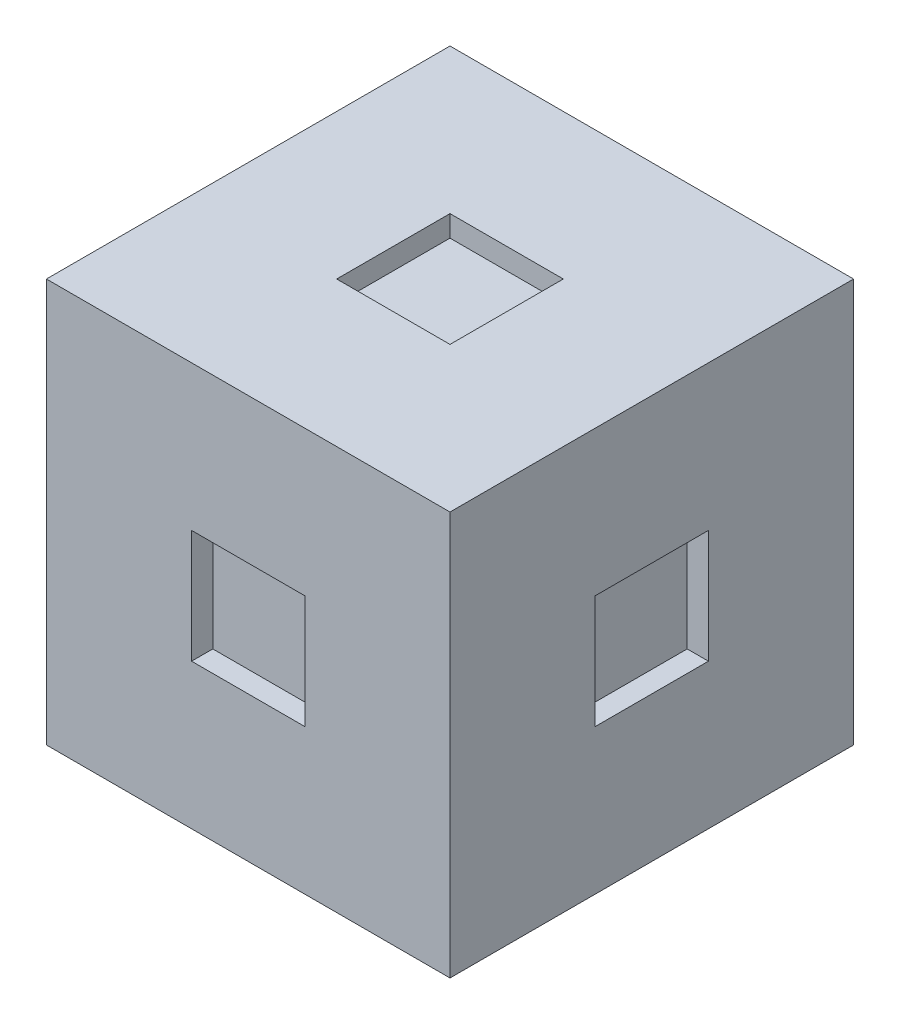
ISO-10303-21;
HEADER;
FILE_DESCRIPTION(('STEP AP214'),'2;1');
FILE_NAME('part.step','',(''),(''),'','','');
FILE_SCHEMA(('AUTOMOTIVE_DESIGN { 1 0 10303 214 1 1 1 1 }'));
ENDSEC;
DATA;
#1=APPLICATION_CONTEXT('core data for automotive mechanical design processes');
#2=APPLICATION_PROTOCOL_DEFINITION('international standard','automotive_design',2000,#1);
#3=PRODUCT_CONTEXT('',#1,'mechanical');
#4=PRODUCT('Part','Part','',(#3));
#5=PRODUCT_RELATED_PRODUCT_CATEGORY('part','',(#4));
#6=PRODUCT_DEFINITION_FORMATION('','',#4);
#7=PRODUCT_DEFINITION_CONTEXT('part definition',#1,'design');
#8=PRODUCT_DEFINITION('design','',#6,#7);
#9=PRODUCT_DEFINITION_SHAPE('','',#8);
#10=(LENGTH_UNIT() NAMED_UNIT(*) SI_UNIT(.MILLI.,.METRE.));
#11=(NAMED_UNIT(*) PLANE_ANGLE_UNIT() SI_UNIT($,.RADIAN.));
#12=(NAMED_UNIT(*) SI_UNIT($,.STERADIAN.) SOLID_ANGLE_UNIT());
#13=UNCERTAINTY_MEASURE_WITH_UNIT(LENGTH_MEASURE(1.E-05),#10,'distance_accuracy_value','');
#14=(GEOMETRIC_REPRESENTATION_CONTEXT(3) GLOBAL_UNCERTAINTY_ASSIGNED_CONTEXT((#13)) GLOBAL_UNIT_ASSIGNED_CONTEXT((#10,
#11,#12)) REPRESENTATION_CONTEXT('',''));
#15=CARTESIAN_POINT('',(0.,0.,0.));
#16=DIRECTION('',(0.,0.,1.));
#17=DIRECTION('',(1.,0.,0.));
#18=AXIS2_PLACEMENT_3D('',#15,#16,#17);
#19=CARTESIAN_POINT('',(28.5,57.,-28.5));
#20=DIRECTION('',(-1.,0.,0.));
#21=DIRECTION('',(0.,0.,1.));
#22=AXIS2_PLACEMENT_3D('',#19,#20,#21);
#23=PLANE('',#22);
#24=DIRECTION('',(0.,0.,1.));
#25=VECTOR('',#24,1.);
#26=CARTESIAN_POINT('',(28.5,36.5,8.));
#27=LINE('',#26,#25);
#28=CARTESIAN_POINT('',(28.5,36.5,-8.));
#29=VERTEX_POINT('',#28);
#30=CARTESIAN_POINT('',(28.5,36.5,8.));
#31=VERTEX_POINT('',#30);
#32=EDGE_CURVE('E426',#29,#31,#27,.T.);
#33=ORIENTED_EDGE('',*,*,#32,.F.);
#34=DIRECTION('',(0.,1.,0.));
#35=VECTOR('',#34,1.);
#36=CARTESIAN_POINT('',(28.5,36.5,-8.));
#37=LINE('',#36,#35);
#38=CARTESIAN_POINT('',(28.5,20.5,-8.));
#39=VERTEX_POINT('',#38);
#40=EDGE_CURVE('E396',#39,#29,#37,.T.);
#41=ORIENTED_EDGE('',*,*,#40,.F.);
#42=DIRECTION('',(0.,0.,-1.));
#43=VECTOR('',#42,1.);
#44=CARTESIAN_POINT('',(28.5,20.5,8.));
#45=LINE('',#44,#43);
#46=CARTESIAN_POINT('',(28.5,20.5,8.));
#47=VERTEX_POINT('',#46);
#48=EDGE_CURVE('E411',#47,#39,#45,.T.);
#49=ORIENTED_EDGE('',*,*,#48,.F.);
#50=DIRECTION('',(0.,-1.,0.));
#51=VECTOR('',#50,1.);
#52=CARTESIAN_POINT('',(28.5,36.5,8.));
#53=LINE('',#52,#51);
#54=EDGE_CURVE('E430',#31,#47,#53,.T.);
#55=ORIENTED_EDGE('',*,*,#54,.F.);
#56=EDGE_LOOP('',(#33,#41,#49,#55));
#57=FACE_BOUND('',#56,.T.);
#58=DIRECTION('',(0.,0.,-1.));
#59=VECTOR('',#58,1.);
#60=CARTESIAN_POINT('',(28.5,0.,-28.5));
#61=LINE('',#60,#59);
#62=CARTESIAN_POINT('',(28.5,0.,28.5));
#63=VERTEX_POINT('',#62);
#64=CARTESIAN_POINT('',(28.5,0.,-28.5));
#65=VERTEX_POINT('',#64);
#66=EDGE_CURVE('E484',#63,#65,#61,.T.);
#67=ORIENTED_EDGE('',*,*,#66,.T.);
#68=DIRECTION('',(0.,-1.,0.));
#69=VECTOR('',#68,1.);
#70=CARTESIAN_POINT('',(28.5,57.,-28.5));
#71=LINE('',#70,#69);
#72=CARTESIAN_POINT('',(28.5,57.,-28.5));
#73=VERTEX_POINT('',#72);
#74=EDGE_CURVE('E11',#73,#65,#71,.T.);
#75=ORIENTED_EDGE('',*,*,#74,.F.);
#76=DIRECTION('',(0.,0.,-1.));
#77=VECTOR('',#76,1.);
#78=CARTESIAN_POINT('',(28.5,57.,-28.5));
#79=LINE('',#78,#77);
#80=CARTESIAN_POINT('',(28.5,57.,28.5));
#81=VERTEX_POINT('',#80);
#82=EDGE_CURVE('E494',#81,#73,#79,.T.);
#83=ORIENTED_EDGE('',*,*,#82,.F.);
#84=DIRECTION('',(0.,-1.,0.));
#85=VECTOR('',#84,1.);
#86=CARTESIAN_POINT('',(28.5,57.,28.5));
#87=LINE('',#86,#85);
#88=EDGE_CURVE('E508',#81,#63,#87,.T.);
#89=ORIENTED_EDGE('',*,*,#88,.T.);
#90=EDGE_LOOP('',(#67,#75,#83,#89));
#91=FACE_BOUND('',#90,.T.);
#92=ADVANCED_FACE('F40',(#57,#91),#23,.F.);
#93=CARTESIAN_POINT('',(-28.5,57.,-28.5));
#94=DIRECTION('',(0.,0.,1.));
#95=DIRECTION('',(1.,0.,0.));
#96=AXIS2_PLACEMENT_3D('',#93,#94,#95);
#97=PLANE('',#96);
#98=DIRECTION('',(1.,0.,0.));
#99=VECTOR('',#98,1.);
#100=CARTESIAN_POINT('',(8.00000000000001,36.5,-28.5));
#101=LINE('',#100,#99);
#102=CARTESIAN_POINT('',(-7.99999999999999,36.5,-28.5));
#103=VERTEX_POINT('',#102);
#104=CARTESIAN_POINT('',(8.00000000000001,36.5,-28.5));
#105=VERTEX_POINT('',#104);
#106=EDGE_CURVE('E382',#103,#105,#101,.T.);
#107=ORIENTED_EDGE('',*,*,#106,.F.);
#108=DIRECTION('',(0.,1.,0.));
#109=VECTOR('',#108,1.);
#110=CARTESIAN_POINT('',(-7.99999999999999,36.5,-28.5));
#111=LINE('',#110,#109);
#112=CARTESIAN_POINT('',(-7.99999999999999,20.5,-28.5));
#113=VERTEX_POINT('',#112);
#114=EDGE_CURVE('E352',#113,#103,#111,.T.);
#115=ORIENTED_EDGE('',*,*,#114,.F.);
#116=DIRECTION('',(-1.,0.,0.));
#117=VECTOR('',#116,1.);
#118=CARTESIAN_POINT('',(8.00000000000001,20.5,-28.5));
#119=LINE('',#118,#117);
#120=CARTESIAN_POINT('',(8.00000000000001,20.5,-28.5));
#121=VERTEX_POINT('',#120);
#122=EDGE_CURVE('E367',#121,#113,#119,.T.);
#123=ORIENTED_EDGE('',*,*,#122,.F.);
#124=DIRECTION('',(0.,-1.,0.));
#125=VECTOR('',#124,1.);
#126=CARTESIAN_POINT('',(8.00000000000001,36.5,-28.5));
#127=LINE('',#126,#125);
#128=EDGE_CURVE('E386',#105,#121,#127,.T.);
#129=ORIENTED_EDGE('',*,*,#128,.F.);
#130=EDGE_LOOP('',(#107,#115,#123,#129));
#131=FACE_BOUND('',#130,.T.);
#132=DIRECTION('',(-1.,0.,0.));
#133=VECTOR('',#132,1.);
#134=CARTESIAN_POINT('',(-28.5,0.,-28.5));
#135=LINE('',#134,#133);
#136=CARTESIAN_POINT('',(-28.5,0.,-28.5));
#137=VERTEX_POINT('',#136);
#138=EDGE_CURVE('E512',#65,#137,#135,.T.);
#139=ORIENTED_EDGE('',*,*,#138,.T.);
#140=DIRECTION('',(0.,-1.,0.));
#141=VECTOR('',#140,1.);
#142=CARTESIAN_POINT('',(-28.5,57.,-28.5));
#143=LINE('',#142,#141);
#144=CARTESIAN_POINT('',(-28.5,57.,-28.5));
#145=VERTEX_POINT('',#144);
#146=EDGE_CURVE('E48',#145,#137,#143,.T.);
#147=ORIENTED_EDGE('',*,*,#146,.F.);
#148=DIRECTION('',(-1.,0.,0.));
#149=VECTOR('',#148,1.);
#150=CARTESIAN_POINT('',(-28.5,57.,-28.5));
#151=LINE('',#150,#149);
#152=EDGE_CURVE('E498',#73,#145,#151,.T.);
#153=ORIENTED_EDGE('',*,*,#152,.F.);
#154=ORIENTED_EDGE('',*,*,#74,.T.);
#155=EDGE_LOOP('',(#139,#147,#153,#154));
#156=FACE_BOUND('',#155,.T.);
#157=ADVANCED_FACE('F548',(#131,#156),#97,.F.);
#158=CARTESIAN_POINT('',(-28.5,57.,-28.5));
#159=DIRECTION('',(1.,0.,0.));
#160=DIRECTION('',(0.,0.,-1.));
#161=AXIS2_PLACEMENT_3D('',#158,#159,#160);
#162=PLANE('',#161);
#163=DIRECTION('',(0.,0.,-1.));
#164=VECTOR('',#163,1.);
#165=CARTESIAN_POINT('',(-28.5,36.5,-8.));
#166=LINE('',#165,#164);
#167=CARTESIAN_POINT('',(-28.5,36.5,8.));
#168=VERTEX_POINT('',#167);
#169=CARTESIAN_POINT('',(-28.5,36.5,-8.));
#170=VERTEX_POINT('',#169);
#171=EDGE_CURVE('E338',#168,#170,#166,.T.);
#172=ORIENTED_EDGE('',*,*,#171,.F.);
#173=DIRECTION('',(0.,1.,0.));
#174=VECTOR('',#173,1.);
#175=CARTESIAN_POINT('',(-28.5,36.5,8.));
#176=LINE('',#175,#174);
#177=CARTESIAN_POINT('',(-28.5,20.5,8.00000000000001));
#178=VERTEX_POINT('',#177);
#179=EDGE_CURVE('E309',#178,#168,#176,.T.);
#180=ORIENTED_EDGE('',*,*,#179,.F.);
#181=DIRECTION('',(0.,0.,1.));
#182=VECTOR('',#181,1.);
#183=CARTESIAN_POINT('',(-28.5,20.5,-7.99999999999999));
#184=LINE('',#183,#182);
#185=CARTESIAN_POINT('',(-28.5,20.5,-7.99999999999999));
#186=VERTEX_POINT('',#185);
#187=EDGE_CURVE('E323',#186,#178,#184,.T.);
#188=ORIENTED_EDGE('',*,*,#187,.F.);
#189=DIRECTION('',(0.,-1.,0.));
#190=VECTOR('',#189,1.);
#191=CARTESIAN_POINT('',(-28.5,36.5,-8.));
#192=LINE('',#191,#190);
#193=EDGE_CURVE('E342',#170,#186,#192,.T.);
#194=ORIENTED_EDGE('',*,*,#193,.F.);
#195=EDGE_LOOP('',(#172,#180,#188,#194));
#196=FACE_BOUND('',#195,.T.);
#197=DIRECTION('',(0.,0.,1.));
#198=VECTOR('',#197,1.);
#199=CARTESIAN_POINT('',(-28.5,0.,-28.5));
#200=LINE('',#199,#198);
#201=CARTESIAN_POINT('',(-28.5,0.,28.5));
#202=VERTEX_POINT('',#201);
#203=EDGE_CURVE('E515',#137,#202,#200,.T.);
#204=ORIENTED_EDGE('',*,*,#203,.T.);
#205=DIRECTION('',(0.,-1.,0.));
#206=VECTOR('',#205,1.);
#207=CARTESIAN_POINT('',(-28.5,57.,28.5));
#208=LINE('',#207,#206);
#209=CARTESIAN_POINT('',(-28.5,57.,28.5));
#210=VERTEX_POINT('',#209);
#211=EDGE_CURVE('E523',#210,#202,#208,.T.);
#212=ORIENTED_EDGE('',*,*,#211,.F.);
#213=DIRECTION('',(0.,0.,1.));
#214=VECTOR('',#213,1.);
#215=CARTESIAN_POINT('',(-28.5,57.,-28.5));
#216=LINE('',#215,#214);
#217=EDGE_CURVE('E502',#145,#210,#216,.T.);
#218=ORIENTED_EDGE('',*,*,#217,.F.);
#219=ORIENTED_EDGE('',*,*,#146,.T.);
#220=EDGE_LOOP('',(#204,#212,#218,#219));
#221=FACE_BOUND('',#220,.T.);
#222=ADVANCED_FACE('F532',(#196,#221),#162,.F.);
#223=CARTESIAN_POINT('',(-28.5,57.,28.5));
#224=DIRECTION('',(0.,0.,-1.));
#225=DIRECTION('',(-1.,0.,0.));
#226=AXIS2_PLACEMENT_3D('',#223,#224,#225);
#227=PLANE('',#226);
#228=DIRECTION('',(-1.,0.,0.));
#229=VECTOR('',#228,1.);
#230=CARTESIAN_POINT('',(-7.99999999999998,36.5,28.5));
#231=LINE('',#230,#229);
#232=CARTESIAN_POINT('',(8.00000000000001,36.5,28.5));
#233=VERTEX_POINT('',#232);
#234=CARTESIAN_POINT('',(-7.99999999999998,36.5,28.5));
#235=VERTEX_POINT('',#234);
#236=EDGE_CURVE('E470',#233,#235,#231,.T.);
#237=ORIENTED_EDGE('',*,*,#236,.F.);
#238=DIRECTION('',(0.,1.,0.));
#239=VECTOR('',#238,1.);
#240=CARTESIAN_POINT('',(8.00000000000002,36.5,28.5));
#241=LINE('',#240,#239);
#242=CARTESIAN_POINT('',(8.00000000000002,20.5,28.5));
#243=VERTEX_POINT('',#242);
#244=EDGE_CURVE('E440',#243,#233,#241,.T.);
#245=ORIENTED_EDGE('',*,*,#244,.F.);
#246=DIRECTION('',(1.,0.,0.));
#247=VECTOR('',#246,1.);
#248=CARTESIAN_POINT('',(-7.99999999999998,20.5,28.5));
#249=LINE('',#248,#247);
#250=CARTESIAN_POINT('',(-7.99999999999998,20.5,28.5));
#251=VERTEX_POINT('',#250);
#252=EDGE_CURVE('E455',#251,#243,#249,.T.);
#253=ORIENTED_EDGE('',*,*,#252,.F.);
#254=DIRECTION('',(0.,-1.,0.));
#255=VECTOR('',#254,1.);
#256=CARTESIAN_POINT('',(-7.99999999999998,36.5,28.5));
#257=LINE('',#256,#255);
#258=EDGE_CURVE('E474',#235,#251,#257,.T.);
#259=ORIENTED_EDGE('',*,*,#258,.F.);
#260=EDGE_LOOP('',(#237,#245,#253,#259));
#261=FACE_BOUND('',#260,.T.);
#262=DIRECTION('',(1.,0.,0.));
#263=VECTOR('',#262,1.);
#264=CARTESIAN_POINT('',(-28.5,0.,28.5));
#265=LINE('',#264,#263);
#266=EDGE_CURVE('E499',#202,#63,#265,.T.);
#267=ORIENTED_EDGE('',*,*,#266,.T.);
#268=ORIENTED_EDGE('',*,*,#88,.F.);
#269=DIRECTION('',(1.,0.,0.));
#270=VECTOR('',#269,1.);
#271=CARTESIAN_POINT('',(-28.5,57.,28.5));
#272=LINE('',#271,#270);
#273=EDGE_CURVE('E505',#210,#81,#272,.T.);
#274=ORIENTED_EDGE('',*,*,#273,.F.);
#275=ORIENTED_EDGE('',*,*,#211,.T.);
#276=EDGE_LOOP('',(#267,#268,#274,#275));
#277=FACE_BOUND('',#276,.T.);
#278=ADVANCED_FACE('F541',(#261,#277),#227,.F.);
#279=CARTESIAN_POINT('',(0.,57.,0.));
#280=DIRECTION('',(0.,1.,0.));
#281=DIRECTION('',(0.,0.,1.));
#282=AXIS2_PLACEMENT_3D('',#279,#280,#281);
#283=PLANE('',#282);
#284=DIRECTION('',(0.,0.,-1.));
#285=VECTOR('',#284,1.);
#286=CARTESIAN_POINT('',(8.,57.,-7.99999999999999));
#287=LINE('',#286,#285);
#288=CARTESIAN_POINT('',(8.,57.,7.99999999999999));
#289=VERTEX_POINT('',#288);
#290=CARTESIAN_POINT('',(8.,57.,-7.99999999999999));
#291=VERTEX_POINT('',#290);
#292=EDGE_CURVE('E63',#289,#291,#287,.T.);
#293=ORIENTED_EDGE('',*,*,#292,.F.);
#294=DIRECTION('',(1.,0.,0.));
#295=VECTOR('',#294,1.);
#296=CARTESIAN_POINT('',(-8.,57.,7.99999999999999));
#297=LINE('',#296,#295);
#298=CARTESIAN_POINT('',(-8.,57.,7.99999999999999));
#299=VERTEX_POINT('',#298);
#300=EDGE_CURVE('E280',#299,#289,#297,.T.);
#301=ORIENTED_EDGE('',*,*,#300,.F.);
#302=DIRECTION('',(0.,0.,1.));
#303=VECTOR('',#302,1.);
#304=CARTESIAN_POINT('',(-8.,57.,-7.99999999999999));
#305=LINE('',#304,#303);
#306=CARTESIAN_POINT('',(-8.,57.,-7.99999999999999));
#307=VERTEX_POINT('',#306);
#308=EDGE_CURVE('E299',#307,#299,#305,.T.);
#309=ORIENTED_EDGE('',*,*,#308,.F.);
#310=DIRECTION('',(-1.,0.,0.));
#311=VECTOR('',#310,1.);
#312=CARTESIAN_POINT('',(-8.,57.,-7.99999999999999));
#313=LINE('',#312,#311);
#314=EDGE_CURVE('E295',#291,#307,#313,.T.);
#315=ORIENTED_EDGE('',*,*,#314,.F.);
#316=EDGE_LOOP('',(#293,#301,#309,#315));
#317=FACE_BOUND('',#316,.T.);
#318=ORIENTED_EDGE('',*,*,#82,.T.);
#319=ORIENTED_EDGE('',*,*,#152,.T.);
#320=ORIENTED_EDGE('',*,*,#217,.T.);
#321=ORIENTED_EDGE('',*,*,#273,.T.);
#322=EDGE_LOOP('',(#318,#319,#320,#321));
#323=FACE_BOUND('',#322,.T.);
#324=ADVANCED_FACE('F547',(#317,#323),#283,.T.);
#325=CARTESIAN_POINT('',(0.,0.,0.));
#326=DIRECTION('',(0.,1.,0.));
#327=DIRECTION('',(0.,0.,1.));
#328=AXIS2_PLACEMENT_3D('',#325,#326,#327);
#329=PLANE('',#328);
#330=DIRECTION('',(1.,0.,0.));
#331=VECTOR('',#330,1.);
#332=CARTESIAN_POINT('',(-8.,0.,-7.99999999999999));
#333=LINE('',#332,#331);
#334=CARTESIAN_POINT('',(-8.,0.,-7.99999999999999));
#335=VERTEX_POINT('',#334);
#336=CARTESIAN_POINT('',(8.,0.,-7.99999999999999));
#337=VERTEX_POINT('',#336);
#338=EDGE_CURVE('E261',#335,#337,#333,.T.);
#339=ORIENTED_EDGE('',*,*,#338,.F.);
#340=DIRECTION('',(0.,0.,-1.));
#341=VECTOR('',#340,1.);
#342=CARTESIAN_POINT('',(-8.,0.,7.99999999999999));
#343=LINE('',#342,#341);
#344=CARTESIAN_POINT('',(-8.,0.,7.99999999999999));
#345=VERTEX_POINT('',#344);
#346=EDGE_CURVE('E55',#345,#335,#343,.T.);
#347=ORIENTED_EDGE('',*,*,#346,.F.);
#348=DIRECTION('',(-1.,0.,0.));
#349=VECTOR('',#348,1.);
#350=CARTESIAN_POINT('',(8.,0.,7.99999999999999));
#351=LINE('',#350,#349);
#352=CARTESIAN_POINT('',(8.,0.,7.99999999999999));
#353=VERTEX_POINT('',#352);
#354=EDGE_CURVE('E248',#353,#345,#351,.T.);
#355=ORIENTED_EDGE('',*,*,#354,.F.);
#356=DIRECTION('',(0.,0.,1.));
#357=VECTOR('',#356,1.);
#358=CARTESIAN_POINT('',(8.,0.,-7.99999999999999));
#359=LINE('',#358,#357);
#360=EDGE_CURVE('E252',#337,#353,#359,.T.);
#361=ORIENTED_EDGE('',*,*,#360,.F.);
#362=EDGE_LOOP('',(#339,#347,#355,#361));
#363=FACE_BOUND('',#362,.T.);
#364=ORIENTED_EDGE('',*,*,#66,.F.);
#365=ORIENTED_EDGE('',*,*,#266,.F.);
#366=ORIENTED_EDGE('',*,*,#203,.F.);
#367=ORIENTED_EDGE('',*,*,#138,.F.);
#368=EDGE_LOOP('',(#364,#365,#366,#367));
#369=FACE_BOUND('',#368,.T.);
#370=ADVANCED_FACE('F538',(#363,#369),#329,.F.);
#371=CARTESIAN_POINT('',(8.00000000000002,36.5,25.5));
#372=DIRECTION('',(1.,0.,0.));
#373=DIRECTION('',(0.,0.,-1.));
#374=AXIS2_PLACEMENT_3D('',#371,#372,#373);
#375=PLANE('',#374);
#376=ORIENTED_EDGE('',*,*,#244,.T.);
#377=DIRECTION('',(0.,0.,1.));
#378=VECTOR('',#377,1.);
#379=CARTESIAN_POINT('',(8.00000000000002,36.5,25.5));
#380=LINE('',#379,#378);
#381=CARTESIAN_POINT('',(8.00000000000002,36.5,25.5));
#382=VERTEX_POINT('',#381);
#383=EDGE_CURVE('E467',#382,#233,#380,.T.);
#384=ORIENTED_EDGE('',*,*,#383,.F.);
#385=DIRECTION('',(0.,1.,0.));
#386=VECTOR('',#385,1.);
#387=CARTESIAN_POINT('',(8.00000000000002,36.5,25.5));
#388=LINE('',#387,#386);
#389=CARTESIAN_POINT('',(8.00000000000002,20.5,25.5));
#390=VERTEX_POINT('',#389);
#391=EDGE_CURVE('E450',#390,#382,#388,.T.);
#392=ORIENTED_EDGE('',*,*,#391,.F.);
#393=DIRECTION('',(0.,0.,1.));
#394=VECTOR('',#393,1.);
#395=CARTESIAN_POINT('',(8.00000000000002,20.5,25.5));
#396=LINE('',#395,#394);
#397=EDGE_CURVE('E481',#390,#243,#396,.T.);
#398=ORIENTED_EDGE('',*,*,#397,.T.);
#399=EDGE_LOOP('',(#376,#384,#392,#398));
#400=FACE_BOUND('',#399,.T.);
#401=ADVANCED_FACE('F565',(#400),#375,.F.);
#402=CARTESIAN_POINT('',(-7.99999999999998,20.5,25.5));
#403=DIRECTION('',(0.,-1.,0.));
#404=DIRECTION('',(0.,0.,-1.));
#405=AXIS2_PLACEMENT_3D('',#402,#403,#404);
#406=PLANE('',#405);
#407=ORIENTED_EDGE('',*,*,#252,.T.);
#408=ORIENTED_EDGE('',*,*,#397,.F.);
#409=DIRECTION('',(1.,0.,0.));
#410=VECTOR('',#409,1.);
#411=CARTESIAN_POINT('',(-7.99999999999998,20.5,25.5));
#412=LINE('',#411,#410);
#413=CARTESIAN_POINT('',(-7.99999999999998,20.5,25.5));
#414=VERTEX_POINT('',#413);
#415=EDGE_CURVE('E463',#414,#390,#412,.T.);
#416=ORIENTED_EDGE('',*,*,#415,.F.);
#417=DIRECTION('',(0.,0.,1.));
#418=VECTOR('',#417,1.);
#419=CARTESIAN_POINT('',(-7.99999999999998,20.5,25.5));
#420=LINE('',#419,#418);
#421=EDGE_CURVE('E485',#414,#251,#420,.T.);
#422=ORIENTED_EDGE('',*,*,#421,.T.);
#423=EDGE_LOOP('',(#407,#408,#416,#422));
#424=FACE_BOUND('',#423,.T.);
#425=ADVANCED_FACE('F572',(#424),#406,.F.);
#426=CARTESIAN_POINT('',(-7.99999999999998,36.5,25.5));
#427=DIRECTION('',(-1.,0.,0.));
#428=DIRECTION('',(0.,0.,1.));
#429=AXIS2_PLACEMENT_3D('',#426,#427,#428);
#430=PLANE('',#429);
#431=ORIENTED_EDGE('',*,*,#258,.T.);
#432=ORIENTED_EDGE('',*,*,#421,.F.);
#433=DIRECTION('',(0.,-1.,0.));
#434=VECTOR('',#433,1.);
#435=CARTESIAN_POINT('',(-7.99999999999998,36.5,25.5));
#436=LINE('',#435,#434);
#437=CARTESIAN_POINT('',(-7.99999999999998,36.5,25.5));
#438=VERTEX_POINT('',#437);
#439=EDGE_CURVE('E459',#438,#414,#436,.T.);
#440=ORIENTED_EDGE('',*,*,#439,.F.);
#441=DIRECTION('',(0.,0.,1.));
#442=VECTOR('',#441,1.);
#443=CARTESIAN_POINT('',(-7.99999999999998,36.5,25.5));
#444=LINE('',#443,#442);
#445=EDGE_CURVE('E488',#438,#235,#444,.T.);
#446=ORIENTED_EDGE('',*,*,#445,.T.);
#447=EDGE_LOOP('',(#431,#432,#440,#446));
#448=FACE_BOUND('',#447,.T.);
#449=ADVANCED_FACE('F578',(#448),#430,.F.);
#450=CARTESIAN_POINT('',(-7.99999999999998,36.5,25.5));
#451=DIRECTION('',(0.,1.,0.));
#452=DIRECTION('',(0.,0.,1.));
#453=AXIS2_PLACEMENT_3D('',#450,#451,#452);
#454=PLANE('',#453);
#455=ORIENTED_EDGE('',*,*,#236,.T.);
#456=ORIENTED_EDGE('',*,*,#445,.F.);
#457=DIRECTION('',(-1.,0.,0.));
#458=VECTOR('',#457,1.);
#459=CARTESIAN_POINT('',(-7.99999999999998,36.5,25.5));
#460=LINE('',#459,#458);
#461=EDGE_CURVE('E454',#382,#438,#460,.T.);
#462=ORIENTED_EDGE('',*,*,#461,.F.);
#463=ORIENTED_EDGE('',*,*,#383,.T.);
#464=EDGE_LOOP('',(#455,#456,#462,#463));
#465=FACE_BOUND('',#464,.T.);
#466=ADVANCED_FACE('F574',(#465),#454,.F.);
#467=CARTESIAN_POINT('',(0.,0.,25.5));
#468=DIRECTION('',(0.,0.,1.));
#469=DIRECTION('',(1.,0.,0.));
#470=AXIS2_PLACEMENT_3D('',#467,#468,#469);
#471=PLANE('',#470);
#472=ORIENTED_EDGE('',*,*,#391,.T.);
#473=ORIENTED_EDGE('',*,*,#461,.T.);
#474=ORIENTED_EDGE('',*,*,#439,.T.);
#475=ORIENTED_EDGE('',*,*,#415,.T.);
#476=EDGE_LOOP('',(#472,#473,#474,#475));
#477=FACE_BOUND('',#476,.T.);
#478=ADVANCED_FACE('F577',(#477),#471,.T.);
#479=CARTESIAN_POINT('',(25.5,36.5,-8.));
#480=DIRECTION('',(0.,0.,-1.));
#481=DIRECTION('',(-1.,0.,0.));
#482=AXIS2_PLACEMENT_3D('',#479,#480,#481);
#483=PLANE('',#482);
#484=ORIENTED_EDGE('',*,*,#40,.T.);
#485=DIRECTION('',(1.,0.,0.));
#486=VECTOR('',#485,1.);
#487=CARTESIAN_POINT('',(25.5,36.5,-8.));
#488=LINE('',#487,#486);
#489=CARTESIAN_POINT('',(25.5,36.5,-8.));
#490=VERTEX_POINT('',#489);
#491=EDGE_CURVE('E423',#490,#29,#488,.T.);
#492=ORIENTED_EDGE('',*,*,#491,.F.);
#493=DIRECTION('',(0.,1.,0.));
#494=VECTOR('',#493,1.);
#495=CARTESIAN_POINT('',(25.5,36.5,-8.));
#496=LINE('',#495,#494);
#497=CARTESIAN_POINT('',(25.5,20.5,-8.));
#498=VERTEX_POINT('',#497);
#499=EDGE_CURVE('E406',#498,#490,#496,.T.);
#500=ORIENTED_EDGE('',*,*,#499,.F.);
#501=DIRECTION('',(1.,0.,0.));
#502=VECTOR('',#501,1.);
#503=CARTESIAN_POINT('',(25.5,20.5,-8.));
#504=LINE('',#503,#502);
#505=EDGE_CURVE('E437',#498,#39,#504,.T.);
#506=ORIENTED_EDGE('',*,*,#505,.T.);
#507=EDGE_LOOP('',(#484,#492,#500,#506));
#508=FACE_BOUND('',#507,.T.);
#509=ADVANCED_FACE('F588',(#508),#483,.F.);
#510=CARTESIAN_POINT('',(25.5,20.5,8.));
#511=DIRECTION('',(0.,-1.,0.));
#512=DIRECTION('',(0.,0.,-1.));
#513=AXIS2_PLACEMENT_3D('',#510,#511,#512);
#514=PLANE('',#513);
#515=ORIENTED_EDGE('',*,*,#48,.T.);
#516=ORIENTED_EDGE('',*,*,#505,.F.);
#517=DIRECTION('',(0.,0.,-1.));
#518=VECTOR('',#517,1.);
#519=CARTESIAN_POINT('',(25.5,20.5,8.));
#520=LINE('',#519,#518);
#521=CARTESIAN_POINT('',(25.5,20.5,8.));
#522=VERTEX_POINT('',#521);
#523=EDGE_CURVE('E419',#522,#498,#520,.T.);
#524=ORIENTED_EDGE('',*,*,#523,.F.);
#525=DIRECTION('',(1.,0.,0.));
#526=VECTOR('',#525,1.);
#527=CARTESIAN_POINT('',(25.5,20.5,8.));
#528=LINE('',#527,#526);
#529=EDGE_CURVE('E441',#522,#47,#528,.T.);
#530=ORIENTED_EDGE('',*,*,#529,.T.);
#531=EDGE_LOOP('',(#515,#516,#524,#530));
#532=FACE_BOUND('',#531,.T.);
#533=ADVANCED_FACE('F592',(#532),#514,.F.);
#534=CARTESIAN_POINT('',(25.5,36.5,8.));
#535=DIRECTION('',(0.,0.,1.));
#536=DIRECTION('',(1.,0.,0.));
#537=AXIS2_PLACEMENT_3D('',#534,#535,#536);
#538=PLANE('',#537);
#539=ORIENTED_EDGE('',*,*,#54,.T.);
#540=ORIENTED_EDGE('',*,*,#529,.F.);
#541=DIRECTION('',(0.,-1.,0.));
#542=VECTOR('',#541,1.);
#543=CARTESIAN_POINT('',(25.5,36.5,8.));
#544=LINE('',#543,#542);
#545=CARTESIAN_POINT('',(25.5,36.5,8.));
#546=VERTEX_POINT('',#545);
#547=EDGE_CURVE('E415',#546,#522,#544,.T.);
#548=ORIENTED_EDGE('',*,*,#547,.F.);
#549=DIRECTION('',(1.,0.,0.));
#550=VECTOR('',#549,1.);
#551=CARTESIAN_POINT('',(25.5,36.5,8.));
#552=LINE('',#551,#550);
#553=EDGE_CURVE('E444',#546,#31,#552,.T.);
#554=ORIENTED_EDGE('',*,*,#553,.T.);
#555=EDGE_LOOP('',(#539,#540,#548,#554));
#556=FACE_BOUND('',#555,.T.);
#557=ADVANCED_FACE('F598',(#556),#538,.F.);
#558=CARTESIAN_POINT('',(25.5,36.5,8.));
#559=DIRECTION('',(0.,1.,0.));
#560=DIRECTION('',(0.,0.,1.));
#561=AXIS2_PLACEMENT_3D('',#558,#559,#560);
#562=PLANE('',#561);
#563=ORIENTED_EDGE('',*,*,#32,.T.);
#564=ORIENTED_EDGE('',*,*,#553,.F.);
#565=DIRECTION('',(0.,0.,1.));
#566=VECTOR('',#565,1.);
#567=CARTESIAN_POINT('',(25.5,36.5,8.));
#568=LINE('',#567,#566);
#569=EDGE_CURVE('E410',#490,#546,#568,.T.);
#570=ORIENTED_EDGE('',*,*,#569,.F.);
#571=ORIENTED_EDGE('',*,*,#491,.T.);
#572=EDGE_LOOP('',(#563,#564,#570,#571));
#573=FACE_BOUND('',#572,.T.);
#574=ADVANCED_FACE('F594',(#573),#562,.F.);
#575=CARTESIAN_POINT('',(25.5,0.,0.));
#576=DIRECTION('',(1.,0.,0.));
#577=DIRECTION('',(0.,0.,-1.));
#578=AXIS2_PLACEMENT_3D('',#575,#576,#577);
#579=PLANE('',#578);
#580=ORIENTED_EDGE('',*,*,#499,.T.);
#581=ORIENTED_EDGE('',*,*,#569,.T.);
#582=ORIENTED_EDGE('',*,*,#547,.T.);
#583=ORIENTED_EDGE('',*,*,#523,.T.);
#584=EDGE_LOOP('',(#580,#581,#582,#583));
#585=FACE_BOUND('',#584,.T.);
#586=ADVANCED_FACE('F597',(#585),#579,.T.);
#587=CARTESIAN_POINT('',(-7.99999999999999,36.5,-25.5));
#588=DIRECTION('',(-1.,0.,0.));
#589=DIRECTION('',(0.,0.,1.));
#590=AXIS2_PLACEMENT_3D('',#587,#588,#589);
#591=PLANE('',#590);
#592=ORIENTED_EDGE('',*,*,#114,.T.);
#593=DIRECTION('',(0.,0.,-1.));
#594=VECTOR('',#593,1.);
#595=CARTESIAN_POINT('',(-7.99999999999999,36.5,-25.5));
#596=LINE('',#595,#594);
#597=CARTESIAN_POINT('',(-7.99999999999999,36.5,-25.5));
#598=VERTEX_POINT('',#597);
#599=EDGE_CURVE('E379',#598,#103,#596,.T.);
#600=ORIENTED_EDGE('',*,*,#599,.F.);
#601=DIRECTION('',(0.,1.,0.));
#602=VECTOR('',#601,1.);
#603=CARTESIAN_POINT('',(-7.99999999999999,36.5,-25.5));
#604=LINE('',#603,#602);
#605=CARTESIAN_POINT('',(-7.99999999999999,20.5,-25.5));
#606=VERTEX_POINT('',#605);
#607=EDGE_CURVE('E362',#606,#598,#604,.T.);
#608=ORIENTED_EDGE('',*,*,#607,.F.);
#609=DIRECTION('',(0.,0.,-1.));
#610=VECTOR('',#609,1.);
#611=CARTESIAN_POINT('',(-7.99999999999999,20.5,-25.5));
#612=LINE('',#611,#610);
#613=EDGE_CURVE('E393',#606,#113,#612,.T.);
#614=ORIENTED_EDGE('',*,*,#613,.T.);
#615=EDGE_LOOP('',(#592,#600,#608,#614));
#616=FACE_BOUND('',#615,.T.);
#617=ADVANCED_FACE('F608',(#616),#591,.F.);
#618=CARTESIAN_POINT('',(8.00000000000001,20.5,-25.5));
#619=DIRECTION('',(0.,-1.,0.));
#620=DIRECTION('',(0.,0.,-1.));
#621=AXIS2_PLACEMENT_3D('',#618,#619,#620);
#622=PLANE('',#621);
#623=ORIENTED_EDGE('',*,*,#122,.T.);
#624=ORIENTED_EDGE('',*,*,#613,.F.);
#625=DIRECTION('',(-1.,0.,0.));
#626=VECTOR('',#625,1.);
#627=CARTESIAN_POINT('',(8.00000000000001,20.5,-25.5));
#628=LINE('',#627,#626);
#629=CARTESIAN_POINT('',(8.00000000000001,20.5,-25.5));
#630=VERTEX_POINT('',#629);
#631=EDGE_CURVE('E375',#630,#606,#628,.T.);
#632=ORIENTED_EDGE('',*,*,#631,.F.);
#633=DIRECTION('',(0.,0.,-1.));
#634=VECTOR('',#633,1.);
#635=CARTESIAN_POINT('',(8.00000000000001,20.5,-25.5));
#636=LINE('',#635,#634);
#637=EDGE_CURVE('E397',#630,#121,#636,.T.);
#638=ORIENTED_EDGE('',*,*,#637,.T.);
#639=EDGE_LOOP('',(#623,#624,#632,#638));
#640=FACE_BOUND('',#639,.T.);
#641=ADVANCED_FACE('F612',(#640),#622,.F.);
#642=CARTESIAN_POINT('',(8.00000000000001,36.5,-25.5));
#643=DIRECTION('',(1.,0.,0.));
#644=DIRECTION('',(0.,0.,-1.));
#645=AXIS2_PLACEMENT_3D('',#642,#643,#644);
#646=PLANE('',#645);
#647=ORIENTED_EDGE('',*,*,#128,.T.);
#648=ORIENTED_EDGE('',*,*,#637,.F.);
#649=DIRECTION('',(0.,-1.,0.));
#650=VECTOR('',#649,1.);
#651=CARTESIAN_POINT('',(8.00000000000001,36.5,-25.5));
#652=LINE('',#651,#650);
#653=CARTESIAN_POINT('',(8.00000000000001,36.5,-25.5));
#654=VERTEX_POINT('',#653);
#655=EDGE_CURVE('E371',#654,#630,#652,.T.);
#656=ORIENTED_EDGE('',*,*,#655,.F.);
#657=DIRECTION('',(0.,0.,-1.));
#658=VECTOR('',#657,1.);
#659=CARTESIAN_POINT('',(8.00000000000001,36.5,-25.5));
#660=LINE('',#659,#658);
#661=EDGE_CURVE('E400',#654,#105,#660,.T.);
#662=ORIENTED_EDGE('',*,*,#661,.T.);
#663=EDGE_LOOP('',(#647,#648,#656,#662));
#664=FACE_BOUND('',#663,.T.);
#665=ADVANCED_FACE('F618',(#664),#646,.F.);
#666=CARTESIAN_POINT('',(8.00000000000001,36.5,-25.5));
#667=DIRECTION('',(0.,1.,0.));
#668=DIRECTION('',(0.,0.,1.));
#669=AXIS2_PLACEMENT_3D('',#666,#667,#668);
#670=PLANE('',#669);
#671=ORIENTED_EDGE('',*,*,#106,.T.);
#672=ORIENTED_EDGE('',*,*,#661,.F.);
#673=DIRECTION('',(1.,0.,0.));
#674=VECTOR('',#673,1.);
#675=CARTESIAN_POINT('',(8.00000000000001,36.5,-25.5));
#676=LINE('',#675,#674);
#677=EDGE_CURVE('E366',#598,#654,#676,.T.);
#678=ORIENTED_EDGE('',*,*,#677,.F.);
#679=ORIENTED_EDGE('',*,*,#599,.T.);
#680=EDGE_LOOP('',(#671,#672,#678,#679));
#681=FACE_BOUND('',#680,.T.);
#682=ADVANCED_FACE('F614',(#681),#670,.F.);
#683=CARTESIAN_POINT('',(0.,0.,-25.5));
#684=DIRECTION('',(0.,0.,-1.));
#685=DIRECTION('',(-1.,0.,0.));
#686=AXIS2_PLACEMENT_3D('',#683,#684,#685);
#687=PLANE('',#686);
#688=ORIENTED_EDGE('',*,*,#607,.T.);
#689=ORIENTED_EDGE('',*,*,#677,.T.);
#690=ORIENTED_EDGE('',*,*,#655,.T.);
#691=ORIENTED_EDGE('',*,*,#631,.T.);
#692=EDGE_LOOP('',(#688,#689,#690,#691));
#693=FACE_BOUND('',#692,.T.);
#694=ADVANCED_FACE('F617',(#693),#687,.T.);
#695=CARTESIAN_POINT('',(-25.5,36.5,8.));
#696=DIRECTION('',(0.,0.,1.));
#697=DIRECTION('',(0.,-1.,0.));
#698=AXIS2_PLACEMENT_3D('',#695,#696,#697);
#699=PLANE('',#698);
#700=ORIENTED_EDGE('',*,*,#179,.T.);
#701=DIRECTION('',(-1.,0.,0.));
#702=VECTOR('',#701,1.);
#703=CARTESIAN_POINT('',(-25.5,36.5,8.));
#704=LINE('',#703,#702);
#705=CARTESIAN_POINT('',(-25.5,36.5,8.));
#706=VERTEX_POINT('',#705);
#707=EDGE_CURVE('E335',#706,#168,#704,.T.);
#708=ORIENTED_EDGE('',*,*,#707,.F.);
#709=DIRECTION('',(0.,1.,0.));
#710=VECTOR('',#709,1.);
#711=CARTESIAN_POINT('',(-25.5,36.5,8.));
#712=LINE('',#711,#710);
#713=CARTESIAN_POINT('',(-25.5,20.5,8.00000000000001));
#714=VERTEX_POINT('',#713);
#715=EDGE_CURVE('E318',#714,#706,#712,.T.);
#716=ORIENTED_EDGE('',*,*,#715,.F.);
#717=DIRECTION('',(-1.,0.,0.));
#718=VECTOR('',#717,1.);
#719=CARTESIAN_POINT('',(-25.5,20.5,8.00000000000001));
#720=LINE('',#719,#718);
#721=EDGE_CURVE('E349',#714,#178,#720,.T.);
#722=ORIENTED_EDGE('',*,*,#721,.T.);
#723=EDGE_LOOP('',(#700,#708,#716,#722));
#724=FACE_BOUND('',#723,.T.);
#725=ADVANCED_FACE('F628',(#724),#699,.F.);
#726=CARTESIAN_POINT('',(-25.5,20.5,-7.99999999999999));
#727=DIRECTION('',(0.,-1.,0.));
#728=DIRECTION('',(0.,0.,-1.));
#729=AXIS2_PLACEMENT_3D('',#726,#727,#728);
#730=PLANE('',#729);
#731=ORIENTED_EDGE('',*,*,#187,.T.);
#732=ORIENTED_EDGE('',*,*,#721,.F.);
#733=DIRECTION('',(0.,0.,1.));
#734=VECTOR('',#733,1.);
#735=CARTESIAN_POINT('',(-25.5,20.5,-7.99999999999999));
#736=LINE('',#735,#734);
#737=CARTESIAN_POINT('',(-25.5,20.5,-7.99999999999999));
#738=VERTEX_POINT('',#737);
#739=EDGE_CURVE('E331',#738,#714,#736,.T.);
#740=ORIENTED_EDGE('',*,*,#739,.F.);
#741=DIRECTION('',(-1.,0.,0.));
#742=VECTOR('',#741,1.);
#743=CARTESIAN_POINT('',(-25.5,20.5,-7.99999999999999));
#744=LINE('',#743,#742);
#745=EDGE_CURVE('E353',#738,#186,#744,.T.);
#746=ORIENTED_EDGE('',*,*,#745,.T.);
#747=EDGE_LOOP('',(#731,#732,#740,#746));
#748=FACE_BOUND('',#747,.T.);
#749=ADVANCED_FACE('F632',(#748),#730,.F.);
#750=CARTESIAN_POINT('',(-25.5,36.5,-8.));
#751=DIRECTION('',(0.,0.,-1.));
#752=DIRECTION('',(0.,1.,0.));
#753=AXIS2_PLACEMENT_3D('',#750,#751,#752);
#754=PLANE('',#753);
#755=ORIENTED_EDGE('',*,*,#193,.T.);
#756=ORIENTED_EDGE('',*,*,#745,.F.);
#757=DIRECTION('',(0.,-1.,0.));
#758=VECTOR('',#757,1.);
#759=CARTESIAN_POINT('',(-25.5,36.5,-8.));
#760=LINE('',#759,#758);
#761=CARTESIAN_POINT('',(-25.5,36.5,-8.));
#762=VERTEX_POINT('',#761);
#763=EDGE_CURVE('E327',#762,#738,#760,.T.);
#764=ORIENTED_EDGE('',*,*,#763,.F.);
#765=DIRECTION('',(-1.,0.,0.));
#766=VECTOR('',#765,1.);
#767=CARTESIAN_POINT('',(-25.5,36.5,-8.));
#768=LINE('',#767,#766);
#769=EDGE_CURVE('E356',#762,#170,#768,.T.);
#770=ORIENTED_EDGE('',*,*,#769,.T.);
#771=EDGE_LOOP('',(#755,#756,#764,#770));
#772=FACE_BOUND('',#771,.T.);
#773=ADVANCED_FACE('F638',(#772),#754,.F.);
#774=CARTESIAN_POINT('',(-25.5,36.5,-8.));
#775=DIRECTION('',(0.,1.,0.));
#776=DIRECTION('',(0.,0.,1.));
#777=AXIS2_PLACEMENT_3D('',#774,#775,#776);
#778=PLANE('',#777);
#779=ORIENTED_EDGE('',*,*,#171,.T.);
#780=ORIENTED_EDGE('',*,*,#769,.F.);
#781=DIRECTION('',(0.,0.,-1.));
#782=VECTOR('',#781,1.);
#783=CARTESIAN_POINT('',(-25.5,36.5,-8.));
#784=LINE('',#783,#782);
#785=EDGE_CURVE('E322',#706,#762,#784,.T.);
#786=ORIENTED_EDGE('',*,*,#785,.F.);
#787=ORIENTED_EDGE('',*,*,#707,.T.);
#788=EDGE_LOOP('',(#779,#780,#786,#787));
#789=FACE_BOUND('',#788,.T.);
#790=ADVANCED_FACE('F634',(#789),#778,.F.);
#791=CARTESIAN_POINT('',(-25.5,0.,0.));
#792=DIRECTION('',(-1.,0.,0.));
#793=DIRECTION('',(0.,0.,1.));
#794=AXIS2_PLACEMENT_3D('',#791,#792,#793);
#795=PLANE('',#794);
#796=ORIENTED_EDGE('',*,*,#715,.T.);
#797=ORIENTED_EDGE('',*,*,#785,.T.);
#798=ORIENTED_EDGE('',*,*,#763,.T.);
#799=ORIENTED_EDGE('',*,*,#739,.T.);
#800=EDGE_LOOP('',(#796,#797,#798,#799));
#801=FACE_BOUND('',#800,.T.);
#802=ADVANCED_FACE('F637',(#801),#795,.T.);
#803=CARTESIAN_POINT('',(8.,54.,-7.99999999999999));
#804=DIRECTION('',(1.,0.,0.));
#805=DIRECTION('',(0.,0.,-1.));
#806=AXIS2_PLACEMENT_3D('',#803,#804,#805);
#807=PLANE('',#806);
#808=ORIENTED_EDGE('',*,*,#292,.T.);
#809=DIRECTION('',(0.,1.,0.));
#810=VECTOR('',#809,1.);
#811=CARTESIAN_POINT('',(8.,54.,-7.99999999999999));
#812=LINE('',#811,#810);
#813=CARTESIAN_POINT('',(8.,54.,-7.99999999999999));
#814=VERTEX_POINT('',#813);
#815=EDGE_CURVE('E292',#814,#291,#812,.T.);
#816=ORIENTED_EDGE('',*,*,#815,.F.);
#817=DIRECTION('',(0.,0.,-1.));
#818=VECTOR('',#817,1.);
#819=CARTESIAN_POINT('',(8.,54.,-7.99999999999999));
#820=LINE('',#819,#818);
#821=CARTESIAN_POINT('',(8.,54.,7.99999999999999));
#822=VERTEX_POINT('',#821);
#823=EDGE_CURVE('E275',#822,#814,#820,.T.);
#824=ORIENTED_EDGE('',*,*,#823,.F.);
#825=DIRECTION('',(0.,1.,0.));
#826=VECTOR('',#825,1.);
#827=CARTESIAN_POINT('',(8.,54.,7.99999999999999));
#828=LINE('',#827,#826);
#829=EDGE_CURVE('E306',#822,#289,#828,.T.);
#830=ORIENTED_EDGE('',*,*,#829,.T.);
#831=EDGE_LOOP('',(#808,#816,#824,#830));
#832=FACE_BOUND('',#831,.T.);
#833=ADVANCED_FACE('F648',(#832),#807,.F.);
#834=CARTESIAN_POINT('',(-8.,54.,7.99999999999999));
#835=DIRECTION('',(0.,0.,1.));
#836=DIRECTION('',(1.,0.,0.));
#837=AXIS2_PLACEMENT_3D('',#834,#835,#836);
#838=PLANE('',#837);
#839=ORIENTED_EDGE('',*,*,#300,.T.);
#840=ORIENTED_EDGE('',*,*,#829,.F.);
#841=DIRECTION('',(1.,0.,0.));
#842=VECTOR('',#841,1.);
#843=CARTESIAN_POINT('',(-8.,54.,7.99999999999999));
#844=LINE('',#843,#842);
#845=CARTESIAN_POINT('',(-8.,54.,7.99999999999999));
#846=VERTEX_POINT('',#845);
#847=EDGE_CURVE('E288',#846,#822,#844,.T.);
#848=ORIENTED_EDGE('',*,*,#847,.F.);
#849=DIRECTION('',(0.,1.,0.));
#850=VECTOR('',#849,1.);
#851=CARTESIAN_POINT('',(-8.,54.,7.99999999999999));
#852=LINE('',#851,#850);
#853=EDGE_CURVE('E310',#846,#299,#852,.T.);
#854=ORIENTED_EDGE('',*,*,#853,.T.);
#855=EDGE_LOOP('',(#839,#840,#848,#854));
#856=FACE_BOUND('',#855,.T.);
#857=ADVANCED_FACE('F652',(#856),#838,.F.);
#858=CARTESIAN_POINT('',(-8.,54.,-7.99999999999999));
#859=DIRECTION('',(-1.,0.,0.));
#860=DIRECTION('',(0.,0.,1.));
#861=AXIS2_PLACEMENT_3D('',#858,#859,#860);
#862=PLANE('',#861);
#863=ORIENTED_EDGE('',*,*,#308,.T.);
#864=ORIENTED_EDGE('',*,*,#853,.F.);
#865=DIRECTION('',(0.,0.,1.));
#866=VECTOR('',#865,1.);
#867=CARTESIAN_POINT('',(-8.,54.,-7.99999999999999));
#868=LINE('',#867,#866);
#869=CARTESIAN_POINT('',(-8.,54.,-7.99999999999999));
#870=VERTEX_POINT('',#869);
#871=EDGE_CURVE('E284',#870,#846,#868,.T.);
#872=ORIENTED_EDGE('',*,*,#871,.F.);
#873=DIRECTION('',(0.,1.,0.));
#874=VECTOR('',#873,1.);
#875=CARTESIAN_POINT('',(-8.,54.,-7.99999999999999));
#876=LINE('',#875,#874);
#877=EDGE_CURVE('E313',#870,#307,#876,.T.);
#878=ORIENTED_EDGE('',*,*,#877,.T.);
#879=EDGE_LOOP('',(#863,#864,#872,#878));
#880=FACE_BOUND('',#879,.T.);
#881=ADVANCED_FACE('F657',(#880),#862,.F.);
#882=CARTESIAN_POINT('',(-8.,54.,-7.99999999999999));
#883=DIRECTION('',(0.,0.,-1.));
#884=DIRECTION('',(-1.,0.,0.));
#885=AXIS2_PLACEMENT_3D('',#882,#883,#884);
#886=PLANE('',#885);
#887=ORIENTED_EDGE('',*,*,#314,.T.);
#888=ORIENTED_EDGE('',*,*,#877,.F.);
#889=DIRECTION('',(-1.,0.,0.));
#890=VECTOR('',#889,1.);
#891=CARTESIAN_POINT('',(-8.,54.,-7.99999999999999));
#892=LINE('',#891,#890);
#893=EDGE_CURVE('E279',#814,#870,#892,.T.);
#894=ORIENTED_EDGE('',*,*,#893,.F.);
#895=ORIENTED_EDGE('',*,*,#815,.T.);
#896=EDGE_LOOP('',(#887,#888,#894,#895));
#897=FACE_BOUND('',#896,.T.);
#898=ADVANCED_FACE('F653',(#897),#886,.F.);
#899=CARTESIAN_POINT('',(0.,54.,0.));
#900=DIRECTION('',(0.,1.,0.));
#901=DIRECTION('',(0.,0.,1.));
#902=AXIS2_PLACEMENT_3D('',#899,#900,#901);
#903=PLANE('',#902);
#904=ORIENTED_EDGE('',*,*,#823,.T.);
#905=ORIENTED_EDGE('',*,*,#893,.T.);
#906=ORIENTED_EDGE('',*,*,#871,.T.);
#907=ORIENTED_EDGE('',*,*,#847,.T.);
#908=EDGE_LOOP('',(#904,#905,#906,#907));
#909=FACE_BOUND('',#908,.T.);
#910=ADVANCED_FACE('F656',(#909),#903,.T.);
#911=CARTESIAN_POINT('',(-8.,3.,7.99999999999999));
#912=DIRECTION('',(-1.,0.,0.));
#913=DIRECTION('',(0.,0.,1.));
#914=AXIS2_PLACEMENT_3D('',#911,#912,#913);
#915=PLANE('',#914);
#916=ORIENTED_EDGE('',*,*,#346,.T.);
#917=DIRECTION('',(0.,-1.,0.));
#918=VECTOR('',#917,1.);
#919=CARTESIAN_POINT('',(-8.,3.,-7.99999999999999));
#920=LINE('',#919,#918);
#921=CARTESIAN_POINT('',(-8.,3.,-7.99999999999999));
#922=VERTEX_POINT('',#921);
#923=EDGE_CURVE('E223',#922,#335,#920,.T.);
#924=ORIENTED_EDGE('',*,*,#923,.F.);
#925=DIRECTION('',(0.,0.,-1.));
#926=VECTOR('',#925,1.);
#927=CARTESIAN_POINT('',(-8.,3.,7.99999999999999));
#928=LINE('',#927,#926);
#929=CARTESIAN_POINT('',(-8.,3.,7.99999999999999));
#930=VERTEX_POINT('',#929);
#931=EDGE_CURVE('E227',#930,#922,#928,.T.);
#932=ORIENTED_EDGE('',*,*,#931,.F.);
#933=DIRECTION('',(0.,-1.,0.));
#934=VECTOR('',#933,1.);
#935=CARTESIAN_POINT('',(-8.,3.,7.99999999999999));
#936=LINE('',#935,#934);
#937=EDGE_CURVE('E267',#930,#345,#936,.T.);
#938=ORIENTED_EDGE('',*,*,#937,.T.);
#939=EDGE_LOOP('',(#916,#924,#932,#938));
#940=FACE_BOUND('',#939,.T.);
#941=ADVANCED_FACE('F225',(#940),#915,.F.);
#942=CARTESIAN_POINT('',(8.,3.,7.99999999999999));
#943=DIRECTION('',(0.,0.,1.));
#944=DIRECTION('',(1.,0.,0.));
#945=AXIS2_PLACEMENT_3D('',#942,#943,#944);
#946=PLANE('',#945);
#947=ORIENTED_EDGE('',*,*,#354,.T.);
#948=ORIENTED_EDGE('',*,*,#937,.F.);
#949=DIRECTION('',(-1.,0.,0.));
#950=VECTOR('',#949,1.);
#951=CARTESIAN_POINT('',(8.,3.,7.99999999999999));
#952=LINE('',#951,#950);
#953=CARTESIAN_POINT('',(8.,3.,7.99999999999999));
#954=VERTEX_POINT('',#953);
#955=EDGE_CURVE('E234',#954,#930,#952,.T.);
#956=ORIENTED_EDGE('',*,*,#955,.F.);
#957=DIRECTION('',(0.,-1.,0.));
#958=VECTOR('',#957,1.);
#959=CARTESIAN_POINT('',(8.,3.,7.99999999999999));
#960=LINE('',#959,#958);
#961=EDGE_CURVE('E270',#954,#353,#960,.T.);
#962=ORIENTED_EDGE('',*,*,#961,.T.);
#963=EDGE_LOOP('',(#947,#948,#956,#962));
#964=FACE_BOUND('',#963,.T.);
#965=ADVANCED_FACE('F670',(#964),#946,.F.);
#966=CARTESIAN_POINT('',(8.,3.,-7.99999999999999));
#967=DIRECTION('',(1.,0.,0.));
#968=DIRECTION('',(0.,0.,-1.));
#969=AXIS2_PLACEMENT_3D('',#966,#967,#968);
#970=PLANE('',#969);
#971=ORIENTED_EDGE('',*,*,#360,.T.);
#972=ORIENTED_EDGE('',*,*,#961,.F.);
#973=DIRECTION('',(0.,0.,1.));
#974=VECTOR('',#973,1.);
#975=CARTESIAN_POINT('',(8.,3.,-7.99999999999999));
#976=LINE('',#975,#974);
#977=CARTESIAN_POINT('',(8.,3.,-7.99999999999999));
#978=VERTEX_POINT('',#977);
#979=EDGE_CURVE('E243',#978,#954,#976,.T.);
#980=ORIENTED_EDGE('',*,*,#979,.F.);
#981=DIRECTION('',(0.,-1.,0.));
#982=VECTOR('',#981,1.);
#983=CARTESIAN_POINT('',(8.,3.,-7.99999999999999));
#984=LINE('',#983,#982);
#985=EDGE_CURVE('E233',#978,#337,#984,.T.);
#986=ORIENTED_EDGE('',*,*,#985,.T.);
#987=EDGE_LOOP('',(#971,#972,#980,#986));
#988=FACE_BOUND('',#987,.T.);
#989=ADVANCED_FACE('F673',(#988),#970,.F.);
#990=CARTESIAN_POINT('',(-8.,3.,-7.99999999999999));
#991=DIRECTION('',(0.,0.,-1.));
#992=DIRECTION('',(-1.,0.,0.));
#993=AXIS2_PLACEMENT_3D('',#990,#991,#992);
#994=PLANE('',#993);
#995=ORIENTED_EDGE('',*,*,#338,.T.);
#996=ORIENTED_EDGE('',*,*,#985,.F.);
#997=DIRECTION('',(1.,0.,0.));
#998=VECTOR('',#997,1.);
#999=CARTESIAN_POINT('',(-8.,3.,-7.99999999999999));
#1000=LINE('',#999,#998);
#1001=EDGE_CURVE('E237',#922,#978,#1000,.T.);
#1002=ORIENTED_EDGE('',*,*,#1001,.F.);
#1003=ORIENTED_EDGE('',*,*,#923,.T.);
#1004=EDGE_LOOP('',(#995,#996,#1002,#1003));
#1005=FACE_BOUND('',#1004,.T.);
#1006=ADVANCED_FACE('F238',(#1005),#994,.F.);
#1007=CARTESIAN_POINT('',(0.,3.,0.));
#1008=DIRECTION('',(0.,-1.,0.));
#1009=DIRECTION('',(0.,0.,-1.));
#1010=AXIS2_PLACEMENT_3D('',#1007,#1008,#1009);
#1011=PLANE('',#1010);
#1012=ORIENTED_EDGE('',*,*,#931,.T.);
#1013=ORIENTED_EDGE('',*,*,#1001,.T.);
#1014=ORIENTED_EDGE('',*,*,#979,.T.);
#1015=ORIENTED_EDGE('',*,*,#955,.T.);
#1016=EDGE_LOOP('',(#1012,#1013,#1014,#1015));
#1017=FACE_BOUND('',#1016,.T.);
#1018=ADVANCED_FACE('F245',(#1017),#1011,.T.);
#1019=CLOSED_SHELL('',(#92,#157,#222,#278,#324,#370,#401,#425,#449,#466,#478,#509,#533,#557,
#574,#586,#617,#641,#665,#682,#694,#725,#749,#773,#790,#802,#833,#857,#881,#898,#910,#941,#965,
#989,#1006,#1018));
#1020=MANIFOLD_SOLID_BREP('B2',#1019);
#1021=ADVANCED_BREP_SHAPE_REPRESENTATION('',(#18,#1020),#14);
#1022=SHAPE_DEFINITION_REPRESENTATION(#9,#1021);
ENDSEC;
END-ISO-10303-21;
